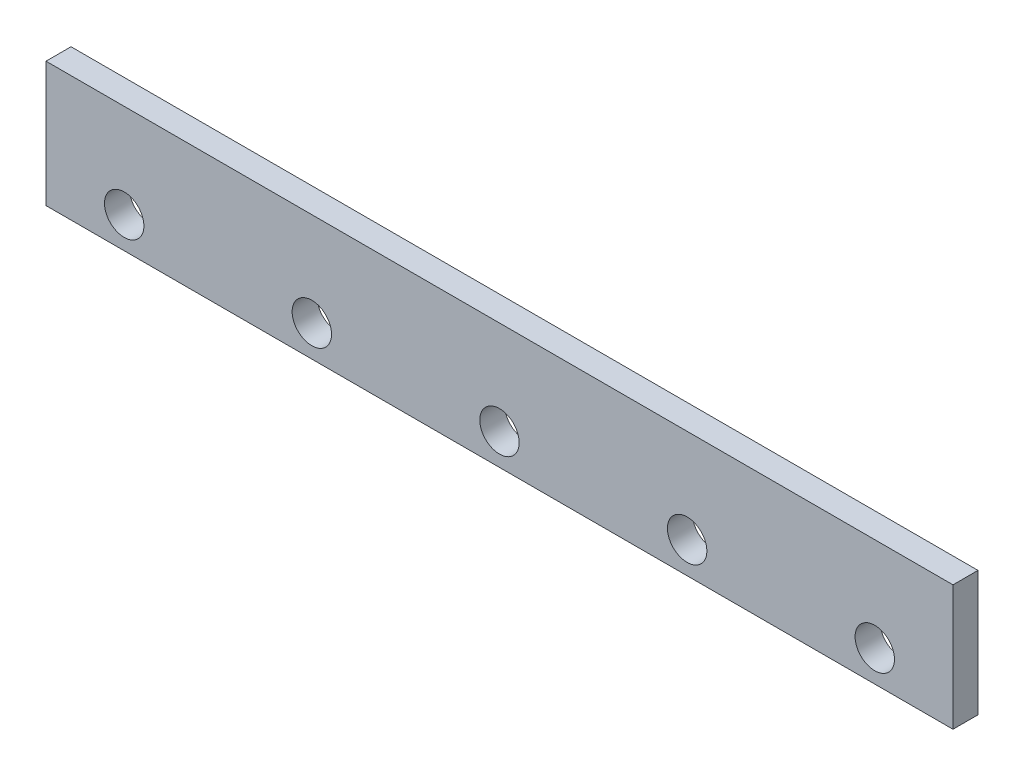
ISO-10303-21;
HEADER;
FILE_DESCRIPTION(('STEP AP214'),'2;1');
FILE_NAME('part.step','',(''),(''),'','','');
FILE_SCHEMA(('AUTOMOTIVE_DESIGN { 1 0 10303 214 1 1 1 1 }'));
ENDSEC;
DATA;
#1=APPLICATION_CONTEXT('core data for automotive mechanical design processes');
#2=APPLICATION_PROTOCOL_DEFINITION('international standard','automotive_design',2000,#1);
#3=PRODUCT_CONTEXT('',#1,'mechanical');
#4=PRODUCT('Part','Part','',(#3));
#5=PRODUCT_RELATED_PRODUCT_CATEGORY('part','',(#4));
#6=PRODUCT_DEFINITION_FORMATION('','',#4);
#7=PRODUCT_DEFINITION_CONTEXT('part definition',#1,'design');
#8=PRODUCT_DEFINITION('design','',#6,#7);
#9=PRODUCT_DEFINITION_SHAPE('','',#8);
#10=(LENGTH_UNIT() NAMED_UNIT(*) SI_UNIT(.MILLI.,.METRE.));
#11=(NAMED_UNIT(*) PLANE_ANGLE_UNIT() SI_UNIT($,.RADIAN.));
#12=(NAMED_UNIT(*) SI_UNIT($,.STERADIAN.) SOLID_ANGLE_UNIT());
#13=UNCERTAINTY_MEASURE_WITH_UNIT(LENGTH_MEASURE(1.E-05),#10,'distance_accuracy_value','');
#14=(GEOMETRIC_REPRESENTATION_CONTEXT(3) GLOBAL_UNCERTAINTY_ASSIGNED_CONTEXT((#13)) GLOBAL_UNIT_ASSIGNED_CONTEXT((#10,
#11,#12)) REPRESENTATION_CONTEXT('',''));
#15=CARTESIAN_POINT('',(0.,0.,0.));
#16=DIRECTION('',(0.,0.,1.));
#17=DIRECTION('',(1.,0.,0.));
#18=AXIS2_PLACEMENT_3D('',#15,#16,#17);
#19=CARTESIAN_POINT('',(0.,0.,16.));
#20=DIRECTION('',(1.,0.,0.));
#21=DIRECTION('',(0.,0.,-1.));
#22=AXIS2_PLACEMENT_3D('',#19,#20,#21);
#23=PLANE('',#22);
#24=DIRECTION('',(0.,-1.,0.));
#25=VECTOR('',#24,1.);
#26=CARTESIAN_POINT('',(0.,0.,0.));
#27=LINE('',#26,#25);
#28=CARTESIAN_POINT('',(0.,80.,0.));
#29=VERTEX_POINT('',#28);
#30=CARTESIAN_POINT('',(0.,0.,0.));
#31=VERTEX_POINT('',#30);
#32=EDGE_CURVE('E96',#29,#31,#27,.T.);
#33=ORIENTED_EDGE('',*,*,#32,.T.);
#34=DIRECTION('',(0.,0.,-1.));
#35=VECTOR('',#34,1.);
#36=CARTESIAN_POINT('',(0.,0.,16.));
#37=LINE('',#36,#35);
#38=CARTESIAN_POINT('',(0.,0.,16.));
#39=VERTEX_POINT('',#38);
#40=EDGE_CURVE('E11',#39,#31,#37,.T.);
#41=ORIENTED_EDGE('',*,*,#40,.F.);
#42=DIRECTION('',(0.,-1.,0.));
#43=VECTOR('',#42,1.);
#44=CARTESIAN_POINT('',(0.,0.,16.));
#45=LINE('',#44,#43);
#46=CARTESIAN_POINT('',(0.,80.,16.));
#47=VERTEX_POINT('',#46);
#48=EDGE_CURVE('E84',#47,#39,#45,.T.);
#49=ORIENTED_EDGE('',*,*,#48,.F.);
#50=DIRECTION('',(0.,0.,-1.));
#51=VECTOR('',#50,1.);
#52=CARTESIAN_POINT('',(0.,80.,16.));
#53=LINE('',#52,#51);
#54=EDGE_CURVE('E92',#47,#29,#53,.T.);
#55=ORIENTED_EDGE('',*,*,#54,.T.);
#56=EDGE_LOOP('',(#33,#41,#49,#55));
#57=FACE_BOUND('',#56,.T.);
#58=ADVANCED_FACE('F33',(#57),#23,.F.);
#59=CARTESIAN_POINT('',(0.,0.,16.));
#60=DIRECTION('',(0.,1.,0.));
#61=DIRECTION('',(0.,0.,1.));
#62=AXIS2_PLACEMENT_3D('',#59,#60,#61);
#63=PLANE('',#62);
#64=DIRECTION('',(1.,0.,0.));
#65=VECTOR('',#64,1.);
#66=CARTESIAN_POINT('',(0.,0.,0.));
#67=LINE('',#66,#65);
#68=CARTESIAN_POINT('',(580.,0.,0.));
#69=VERTEX_POINT('',#68);
#70=EDGE_CURVE('E88',#31,#69,#67,.T.);
#71=ORIENTED_EDGE('',*,*,#70,.T.);
#72=DIRECTION('',(0.,0.,-1.));
#73=VECTOR('',#72,1.);
#74=CARTESIAN_POINT('',(580.,0.,16.));
#75=LINE('',#74,#73);
#76=CARTESIAN_POINT('',(580.,0.,16.));
#77=VERTEX_POINT('',#76);
#78=EDGE_CURVE('E41',#77,#69,#75,.T.);
#79=ORIENTED_EDGE('',*,*,#78,.F.);
#80=DIRECTION('',(1.,0.,0.));
#81=VECTOR('',#80,1.);
#82=CARTESIAN_POINT('',(0.,0.,16.));
#83=LINE('',#82,#81);
#84=EDGE_CURVE('E79',#39,#77,#83,.T.);
#85=ORIENTED_EDGE('',*,*,#84,.F.);
#86=ORIENTED_EDGE('',*,*,#40,.T.);
#87=EDGE_LOOP('',(#71,#79,#85,#86));
#88=FACE_BOUND('',#87,.T.);
#89=ADVANCED_FACE('F87',(#88),#63,.F.);
#90=CARTESIAN_POINT('',(580.,0.,16.));
#91=DIRECTION('',(-1.,0.,0.));
#92=DIRECTION('',(0.,0.,1.));
#93=AXIS2_PLACEMENT_3D('',#90,#91,#92);
#94=PLANE('',#93);
#95=DIRECTION('',(0.,1.,0.));
#96=VECTOR('',#95,1.);
#97=CARTESIAN_POINT('',(580.,0.,0.));
#98=LINE('',#97,#96);
#99=CARTESIAN_POINT('',(580.,80.,0.));
#100=VERTEX_POINT('',#99);
#101=EDGE_CURVE('E66',#69,#100,#98,.T.);
#102=ORIENTED_EDGE('',*,*,#101,.T.);
#103=DIRECTION('',(0.,0.,-1.));
#104=VECTOR('',#103,1.);
#105=CARTESIAN_POINT('',(580.,80.,16.));
#106=LINE('',#105,#104);
#107=CARTESIAN_POINT('',(580.,80.,16.));
#108=VERTEX_POINT('',#107);
#109=EDGE_CURVE('E89',#108,#100,#106,.T.);
#110=ORIENTED_EDGE('',*,*,#109,.F.);
#111=DIRECTION('',(0.,1.,0.));
#112=VECTOR('',#111,1.);
#113=CARTESIAN_POINT('',(580.,0.,16.));
#114=LINE('',#113,#112);
#115=EDGE_CURVE('E82',#77,#108,#114,.T.);
#116=ORIENTED_EDGE('',*,*,#115,.F.);
#117=ORIENTED_EDGE('',*,*,#78,.T.);
#118=EDGE_LOOP('',(#102,#110,#116,#117));
#119=FACE_BOUND('',#118,.T.);
#120=ADVANCED_FACE('F90',(#119),#94,.F.);
#121=CARTESIAN_POINT('',(0.,80.,16.));
#122=DIRECTION('',(0.,-1.,0.));
#123=DIRECTION('',(0.,0.,-1.));
#124=AXIS2_PLACEMENT_3D('',#121,#122,#123);
#125=PLANE('',#124);
#126=DIRECTION('',(-1.,0.,0.));
#127=VECTOR('',#126,1.);
#128=CARTESIAN_POINT('',(0.,80.,0.));
#129=LINE('',#128,#127);
#130=EDGE_CURVE('E72',#100,#29,#129,.T.);
#131=ORIENTED_EDGE('',*,*,#130,.T.);
#132=ORIENTED_EDGE('',*,*,#54,.F.);
#133=DIRECTION('',(-1.,0.,0.));
#134=VECTOR('',#133,1.);
#135=CARTESIAN_POINT('',(0.,80.,16.));
#136=LINE('',#135,#134);
#137=EDGE_CURVE('E49',#108,#47,#136,.T.);
#138=ORIENTED_EDGE('',*,*,#137,.F.);
#139=ORIENTED_EDGE('',*,*,#109,.T.);
#140=EDGE_LOOP('',(#131,#132,#138,#139));
#141=FACE_BOUND('',#140,.T.);
#142=ADVANCED_FACE('F104',(#141),#125,.F.);
#143=CARTESIAN_POINT('',(0.,0.,16.));
#144=DIRECTION('',(0.,0.,-1.));
#145=DIRECTION('',(-1.,0.,0.));
#146=AXIS2_PLACEMENT_3D('',#143,#144,#145);
#147=PLANE('',#146);
#148=CARTESIAN_POINT('',(530.,20.,16.));
#149=DIRECTION('',(0.,0.,1.));
#150=DIRECTION('',(1.,0.,0.));
#151=AXIS2_PLACEMENT_3D('',#148,#149,#150);
#152=CIRCLE('',#151,12.5999999999999);
#153=CARTESIAN_POINT('',(542.6,20.,16.));
#154=VERTEX_POINT('',#153);
#155=EDGE_CURVE('E134',#154,#154,#152,.T.);
#156=ORIENTED_EDGE('',*,*,#155,.F.);
#157=EDGE_LOOP('',(#156));
#158=FACE_BOUND('',#157,.T.);
#159=CARTESIAN_POINT('',(410.,20.,16.));
#160=DIRECTION('',(0.,0.,1.));
#161=DIRECTION('',(1.,0.,0.));
#162=AXIS2_PLACEMENT_3D('',#159,#160,#161);
#163=CIRCLE('',#162,12.6);
#164=CARTESIAN_POINT('',(422.6,20.,16.));
#165=VERTEX_POINT('',#164);
#166=EDGE_CURVE('E128',#165,#165,#163,.T.);
#167=ORIENTED_EDGE('',*,*,#166,.F.);
#168=EDGE_LOOP('',(#167));
#169=FACE_BOUND('',#168,.T.);
#170=CARTESIAN_POINT('',(290.,20.,16.));
#171=DIRECTION('',(0.,0.,1.));
#172=DIRECTION('',(1.,0.,0.));
#173=AXIS2_PLACEMENT_3D('',#170,#171,#172);
#174=CIRCLE('',#173,12.6);
#175=CARTESIAN_POINT('',(302.6,20.,16.));
#176=VERTEX_POINT('',#175);
#177=EDGE_CURVE('E122',#176,#176,#174,.T.);
#178=ORIENTED_EDGE('',*,*,#177,.F.);
#179=EDGE_LOOP('',(#178));
#180=FACE_BOUND('',#179,.T.);
#181=CARTESIAN_POINT('',(170.,20.,16.));
#182=DIRECTION('',(0.,0.,1.));
#183=DIRECTION('',(1.,0.,0.));
#184=AXIS2_PLACEMENT_3D('',#181,#182,#183);
#185=CIRCLE('',#184,12.6);
#186=CARTESIAN_POINT('',(182.6,20.,16.));
#187=VERTEX_POINT('',#186);
#188=EDGE_CURVE('E116',#187,#187,#185,.T.);
#189=ORIENTED_EDGE('',*,*,#188,.F.);
#190=EDGE_LOOP('',(#189));
#191=FACE_BOUND('',#190,.T.);
#192=CARTESIAN_POINT('',(50.,20.,16.));
#193=DIRECTION('',(0.,0.,1.));
#194=DIRECTION('',(1.,0.,0.));
#195=AXIS2_PLACEMENT_3D('',#192,#193,#194);
#196=CIRCLE('',#195,12.6);
#197=CARTESIAN_POINT('',(62.6,20.,16.));
#198=VERTEX_POINT('',#197);
#199=EDGE_CURVE('E110',#198,#198,#196,.T.);
#200=ORIENTED_EDGE('',*,*,#199,.F.);
#201=EDGE_LOOP('',(#200));
#202=FACE_BOUND('',#201,.T.);
#203=ORIENTED_EDGE('',*,*,#48,.T.);
#204=ORIENTED_EDGE('',*,*,#84,.T.);
#205=ORIENTED_EDGE('',*,*,#115,.T.);
#206=ORIENTED_EDGE('',*,*,#137,.T.);
#207=EDGE_LOOP('',(#203,#204,#205,#206));
#208=FACE_BOUND('',#207,.T.);
#209=ADVANCED_FACE('F80',(#158,#169,#180,#191,#202,#208),#147,.F.);
#210=CARTESIAN_POINT('',(0.,0.,0.));
#211=DIRECTION('',(0.,0.,-1.));
#212=DIRECTION('',(-1.,0.,0.));
#213=AXIS2_PLACEMENT_3D('',#210,#211,#212);
#214=PLANE('',#213);
#215=CARTESIAN_POINT('',(530.,20.,0.));
#216=DIRECTION('',(0.,0.,1.));
#217=DIRECTION('',(1.,0.,0.));
#218=AXIS2_PLACEMENT_3D('',#215,#216,#217);
#219=CIRCLE('',#218,12.5999999999999);
#220=CARTESIAN_POINT('',(542.6,20.,0.));
#221=VERTEX_POINT('',#220);
#222=EDGE_CURVE('E131',#221,#221,#219,.T.);
#223=ORIENTED_EDGE('',*,*,#222,.T.);
#224=EDGE_LOOP('',(#223));
#225=FACE_BOUND('',#224,.T.);
#226=CARTESIAN_POINT('',(410.,20.,0.));
#227=DIRECTION('',(0.,0.,1.));
#228=DIRECTION('',(1.,0.,0.));
#229=AXIS2_PLACEMENT_3D('',#226,#227,#228);
#230=CIRCLE('',#229,12.6);
#231=CARTESIAN_POINT('',(422.6,20.,0.));
#232=VERTEX_POINT('',#231);
#233=EDGE_CURVE('E125',#232,#232,#230,.T.);
#234=ORIENTED_EDGE('',*,*,#233,.T.);
#235=EDGE_LOOP('',(#234));
#236=FACE_BOUND('',#235,.T.);
#237=CARTESIAN_POINT('',(290.,20.,0.));
#238=DIRECTION('',(0.,0.,1.));
#239=DIRECTION('',(1.,0.,0.));
#240=AXIS2_PLACEMENT_3D('',#237,#238,#239);
#241=CIRCLE('',#240,12.6);
#242=CARTESIAN_POINT('',(302.6,20.,0.));
#243=VERTEX_POINT('',#242);
#244=EDGE_CURVE('E119',#243,#243,#241,.T.);
#245=ORIENTED_EDGE('',*,*,#244,.T.);
#246=EDGE_LOOP('',(#245));
#247=FACE_BOUND('',#246,.T.);
#248=CARTESIAN_POINT('',(170.,20.,0.));
#249=DIRECTION('',(0.,0.,1.));
#250=DIRECTION('',(1.,0.,0.));
#251=AXIS2_PLACEMENT_3D('',#248,#249,#250);
#252=CIRCLE('',#251,12.6);
#253=CARTESIAN_POINT('',(182.6,20.,0.));
#254=VERTEX_POINT('',#253);
#255=EDGE_CURVE('E113',#254,#254,#252,.T.);
#256=ORIENTED_EDGE('',*,*,#255,.T.);
#257=EDGE_LOOP('',(#256));
#258=FACE_BOUND('',#257,.T.);
#259=CARTESIAN_POINT('',(50.,20.,0.));
#260=DIRECTION('',(0.,0.,1.));
#261=DIRECTION('',(1.,0.,0.));
#262=AXIS2_PLACEMENT_3D('',#259,#260,#261);
#263=CIRCLE('',#262,12.6);
#264=CARTESIAN_POINT('',(62.6,20.,0.));
#265=VERTEX_POINT('',#264);
#266=EDGE_CURVE('E99',#265,#265,#263,.T.);
#267=ORIENTED_EDGE('',*,*,#266,.T.);
#268=EDGE_LOOP('',(#267));
#269=FACE_BOUND('',#268,.T.);
#270=ORIENTED_EDGE('',*,*,#32,.F.);
#271=ORIENTED_EDGE('',*,*,#130,.F.);
#272=ORIENTED_EDGE('',*,*,#101,.F.);
#273=ORIENTED_EDGE('',*,*,#70,.F.);
#274=EDGE_LOOP('',(#270,#271,#272,#273));
#275=FACE_BOUND('',#274,.T.);
#276=ADVANCED_FACE('F107',(#225,#236,#247,#258,#269,#275),#214,.T.);
#277=CARTESIAN_POINT('',(50.,20.,0.));
#278=DIRECTION('',(0.,0.,1.));
#279=DIRECTION('',(1.,0.,0.));
#280=AXIS2_PLACEMENT_3D('',#277,#278,#279);
#281=CYLINDRICAL_SURFACE('',#280,12.6);
#282=ORIENTED_EDGE('',*,*,#266,.F.);
#283=EDGE_LOOP('',(#282));
#284=FACE_BOUND('',#283,.T.);
#285=ORIENTED_EDGE('',*,*,#199,.T.);
#286=EDGE_LOOP('',(#285));
#287=FACE_BOUND('',#286,.T.);
#288=ADVANCED_FACE('F160',(#284,#287),#281,.F.);
#289=CARTESIAN_POINT('',(170.,20.,0.));
#290=DIRECTION('',(0.,0.,1.));
#291=DIRECTION('',(1.,0.,0.));
#292=AXIS2_PLACEMENT_3D('',#289,#290,#291);
#293=CYLINDRICAL_SURFACE('',#292,12.6);
#294=ORIENTED_EDGE('',*,*,#255,.F.);
#295=EDGE_LOOP('',(#294));
#296=FACE_BOUND('',#295,.T.);
#297=ORIENTED_EDGE('',*,*,#188,.T.);
#298=EDGE_LOOP('',(#297));
#299=FACE_BOUND('',#298,.T.);
#300=ADVANCED_FACE('F162',(#296,#299),#293,.F.);
#301=CARTESIAN_POINT('',(290.,20.,0.));
#302=DIRECTION('',(0.,0.,1.));
#303=DIRECTION('',(1.,0.,0.));
#304=AXIS2_PLACEMENT_3D('',#301,#302,#303);
#305=CYLINDRICAL_SURFACE('',#304,12.6);
#306=ORIENTED_EDGE('',*,*,#244,.F.);
#307=EDGE_LOOP('',(#306));
#308=FACE_BOUND('',#307,.T.);
#309=ORIENTED_EDGE('',*,*,#177,.T.);
#310=EDGE_LOOP('',(#309));
#311=FACE_BOUND('',#310,.T.);
#312=ADVANCED_FACE('F169',(#308,#311),#305,.F.);
#313=CARTESIAN_POINT('',(410.,20.,0.));
#314=DIRECTION('',(0.,0.,1.));
#315=DIRECTION('',(1.,0.,0.));
#316=AXIS2_PLACEMENT_3D('',#313,#314,#315);
#317=CYLINDRICAL_SURFACE('',#316,12.6);
#318=ORIENTED_EDGE('',*,*,#233,.F.);
#319=EDGE_LOOP('',(#318));
#320=FACE_BOUND('',#319,.T.);
#321=ORIENTED_EDGE('',*,*,#166,.T.);
#322=EDGE_LOOP('',(#321));
#323=FACE_BOUND('',#322,.T.);
#324=ADVANCED_FACE('F145',(#320,#323),#317,.F.);
#325=CARTESIAN_POINT('',(530.,20.,0.));
#326=DIRECTION('',(0.,0.,1.));
#327=DIRECTION('',(1.,0.,0.));
#328=AXIS2_PLACEMENT_3D('',#325,#326,#327);
#329=CYLINDRICAL_SURFACE('',#328,12.5999999999999);
#330=ORIENTED_EDGE('',*,*,#222,.F.);
#331=EDGE_LOOP('',(#330));
#332=FACE_BOUND('',#331,.T.);
#333=ORIENTED_EDGE('',*,*,#155,.T.);
#334=EDGE_LOOP('',(#333));
#335=FACE_BOUND('',#334,.T.);
#336=ADVANCED_FACE('F142',(#332,#335),#329,.F.);
#337=CLOSED_SHELL('',(#58,#89,#120,#142,#209,#276,#288,#300,#312,#324,#336));
#338=MANIFOLD_SOLID_BREP('B2',#337);
#339=ADVANCED_BREP_SHAPE_REPRESENTATION('',(#18,#338),#14);
#340=SHAPE_DEFINITION_REPRESENTATION(#9,#339);
ENDSEC;
END-ISO-10303-21;
